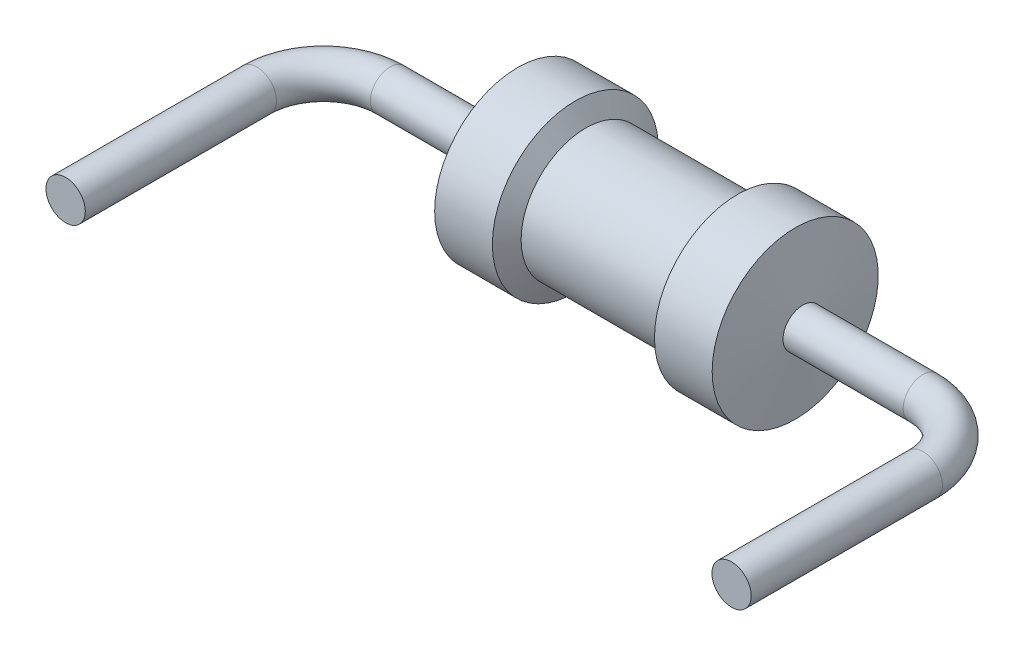
ISO-10303-21;
HEADER;
FILE_DESCRIPTION(('STEP AP214'),'2;1');
FILE_NAME('part.step','',(''),(''),'','','');
FILE_SCHEMA(('AUTOMOTIVE_DESIGN { 1 0 10303 214 1 1 1 1 }'));
ENDSEC;
DATA;
#1=APPLICATION_CONTEXT('core data for automotive mechanical design processes');
#2=APPLICATION_PROTOCOL_DEFINITION('international standard','automotive_design',2000,#1);
#3=PRODUCT_CONTEXT('',#1,'mechanical');
#4=PRODUCT('Part','Part','',(#3));
#5=PRODUCT_RELATED_PRODUCT_CATEGORY('part','',(#4));
#6=PRODUCT_DEFINITION_FORMATION('','',#4);
#7=PRODUCT_DEFINITION_CONTEXT('part definition',#1,'design');
#8=PRODUCT_DEFINITION('design','',#6,#7);
#9=PRODUCT_DEFINITION_SHAPE('','',#8);
#10=(LENGTH_UNIT() NAMED_UNIT(*) SI_UNIT(.MILLI.,.METRE.));
#11=(NAMED_UNIT(*) PLANE_ANGLE_UNIT() SI_UNIT($,.RADIAN.));
#12=(NAMED_UNIT(*) SI_UNIT($,.STERADIAN.) SOLID_ANGLE_UNIT());
#13=UNCERTAINTY_MEASURE_WITH_UNIT(LENGTH_MEASURE(1.E-05),#10,'distance_accuracy_value','');
#14=(GEOMETRIC_REPRESENTATION_CONTEXT(3) GLOBAL_UNCERTAINTY_ASSIGNED_CONTEXT((#13)) GLOBAL_UNIT_ASSIGNED_CONTEXT((#10,
#11,#12)) REPRESENTATION_CONTEXT('',''));
#15=CARTESIAN_POINT('',(0.,0.,0.));
#16=DIRECTION('',(0.,0.,1.));
#17=DIRECTION('',(1.,0.,0.));
#18=AXIS2_PLACEMENT_3D('',#15,#16,#17);
#19=CARTESIAN_POINT('',(5.51,0.,0.));
#20=DIRECTION('',(-1.,0.,0.));
#21=DIRECTION('',(0.,0.,1.));
#22=AXIS2_PLACEMENT_3D('',#19,#20,#21);
#23=CONICAL_SURFACE('',#22,0.,1.45312202164846);
#24=CARTESIAN_POINT('',(5.39769053882616,0.,0.));
#25=DIRECTION('',(-1.,0.,0.));
#26=DIRECTION('',(0.,0.,1.));
#27=AXIS2_PLACEMENT_3D('',#24,#25,#26);
#28=CIRCLE('',#27,0.95);
#29=CARTESIAN_POINT('',(5.39769053882616,0.,0.95));
#30=VERTEX_POINT('',#29);
#31=EDGE_CURVE('E42',#30,#30,#28,.T.);
#32=ORIENTED_EDGE('',*,*,#31,.F.);
#33=EDGE_LOOP('',(#32));
#34=FACE_BOUND('',#33,.T.);
#35=CARTESIAN_POINT('',(5.48340039077461,0.,0.));
#36=DIRECTION('',(-1.,0.,0.));
#37=DIRECTION('',(0.,0.,1.));
#38=AXIS2_PLACEMENT_3D('',#35,#36,#37);
#39=CIRCLE('',#38,0.225);
#40=CARTESIAN_POINT('',(5.48340039077461,0.,0.225));
#41=VERTEX_POINT('',#40);
#42=EDGE_CURVE('E10',#41,#41,#39,.F.);
#43=ORIENTED_EDGE('',*,*,#42,.F.);
#44=EDGE_LOOP('',(#43));
#45=FACE_BOUND('',#44,.T.);
#46=ADVANCED_FACE('F31',(#34,#45),#23,.T.);
#47=CARTESIAN_POINT('',(2.22230946117384,0.,0.));
#48=DIRECTION('',(1.,0.,0.));
#49=DIRECTION('',(0.,0.,-1.));
#50=AXIS2_PLACEMENT_3D('',#47,#48,#49);
#51=CONICAL_SURFACE('',#50,0.95,1.45312202164846);
#52=CARTESIAN_POINT('',(2.22230946117384,0.,0.));
#53=DIRECTION('',(-1.,0.,0.));
#54=DIRECTION('',(0.,0.,1.));
#55=AXIS2_PLACEMENT_3D('',#52,#53,#54);
#56=CIRCLE('',#55,0.95);
#57=CARTESIAN_POINT('',(2.22230946117384,0.,0.95));
#58=VERTEX_POINT('',#57);
#59=EDGE_CURVE('E47',#58,#58,#56,.T.);
#60=ORIENTED_EDGE('',*,*,#59,.T.);
#61=EDGE_LOOP('',(#60));
#62=FACE_BOUND('',#61,.T.);
#63=CARTESIAN_POINT('',(2.13659960922538,0.,0.));
#64=DIRECTION('',(1.,0.,0.));
#65=DIRECTION('',(0.,0.,-1.));
#66=AXIS2_PLACEMENT_3D('',#63,#64,#65);
#67=CIRCLE('',#66,0.225);
#68=CARTESIAN_POINT('',(2.13659960922538,0.,-0.225));
#69=VERTEX_POINT('',#68);
#70=EDGE_CURVE('E34',#69,#69,#67,.F.);
#71=ORIENTED_EDGE('',*,*,#70,.F.);
#72=EDGE_LOOP('',(#71));
#73=FACE_BOUND('',#72,.T.);
#74=ADVANCED_FACE('F68',(#62,#73),#51,.T.);
#75=CARTESIAN_POINT('',(0.,0.,0.));
#76=DIRECTION('',(-1.,0.,0.));
#77=DIRECTION('',(0.,0.,1.));
#78=AXIS2_PLACEMENT_3D('',#75,#76,#77);
#79=CYLINDRICAL_SURFACE('',#78,0.95);
#80=CARTESIAN_POINT('',(4.73729053882616,0.,0.));
#81=DIRECTION('',(-1.,0.,0.));
#82=DIRECTION('',(0.,0.,1.));
#83=AXIS2_PLACEMENT_3D('',#80,#81,#82);
#84=CIRCLE('',#83,0.95);
#85=CARTESIAN_POINT('',(4.73729053882616,0.,0.95));
#86=VERTEX_POINT('',#85);
#87=EDGE_CURVE('E59',#86,#86,#84,.T.);
#88=ORIENTED_EDGE('',*,*,#87,.F.);
#89=EDGE_LOOP('',(#88));
#90=FACE_BOUND('',#89,.T.);
#91=ORIENTED_EDGE('',*,*,#31,.T.);
#92=EDGE_LOOP('',(#91));
#93=FACE_BOUND('',#92,.T.);
#94=ADVANCED_FACE('F64',(#90,#93),#79,.T.);
#95=CARTESIAN_POINT('',(4.73729053882616,0.,0.));
#96=DIRECTION('',(1.,0.,0.));
#97=DIRECTION('',(0.,0.,-1.));
#98=AXIS2_PLACEMENT_3D('',#95,#96,#97);
#99=CONICAL_SURFACE('',#98,0.95,1.0569985691051);
#100=CARTESIAN_POINT('',(4.61867420705743,0.,0.));
#101=DIRECTION('',(-1.,0.,0.));
#102=DIRECTION('',(0.,0.,1.));
#103=AXIS2_PLACEMENT_3D('',#100,#101,#102);
#104=CIRCLE('',#103,0.73981978437736);
#105=CARTESIAN_POINT('',(4.61867420705743,0.,0.73981978437736));
#106=VERTEX_POINT('',#105);
#107=EDGE_CURVE('E56',#106,#106,#104,.T.);
#108=ORIENTED_EDGE('',*,*,#107,.F.);
#109=EDGE_LOOP('',(#108));
#110=FACE_BOUND('',#109,.T.);
#111=ORIENTED_EDGE('',*,*,#87,.T.);
#112=EDGE_LOOP('',(#111));
#113=FACE_BOUND('',#112,.T.);
#114=ADVANCED_FACE('F77',(#110,#113),#99,.T.);
#115=CARTESIAN_POINT('',(0.,0.,0.));
#116=DIRECTION('',(-1.,0.,0.));
#117=DIRECTION('',(0.,0.,1.));
#118=AXIS2_PLACEMENT_3D('',#115,#116,#117);
#119=CYLINDRICAL_SURFACE('',#118,0.73981978437736);
#120=CARTESIAN_POINT('',(3.00132579294256,0.,0.));
#121=DIRECTION('',(-1.,0.,0.));
#122=DIRECTION('',(0.,0.,1.));
#123=AXIS2_PLACEMENT_3D('',#120,#121,#122);
#124=CIRCLE('',#123,0.73981978437736);
#125=CARTESIAN_POINT('',(3.00132579294256,0.,0.73981978437736));
#126=VERTEX_POINT('',#125);
#127=EDGE_CURVE('E53',#126,#126,#124,.T.);
#128=ORIENTED_EDGE('',*,*,#127,.F.);
#129=EDGE_LOOP('',(#128));
#130=FACE_BOUND('',#129,.T.);
#131=ORIENTED_EDGE('',*,*,#107,.T.);
#132=EDGE_LOOP('',(#131));
#133=FACE_BOUND('',#132,.T.);
#134=ADVANCED_FACE('F92',(#130,#133),#119,.T.);
#135=CARTESIAN_POINT('',(3.00132579294256,0.,0.));
#136=DIRECTION('',(-1.,0.,0.));
#137=DIRECTION('',(0.,0.,1.));
#138=AXIS2_PLACEMENT_3D('',#135,#136,#137);
#139=CONICAL_SURFACE('',#138,0.73981978437736,1.0569985691051);
#140=CARTESIAN_POINT('',(2.88270946117384,0.,0.));
#141=DIRECTION('',(-1.,0.,0.));
#142=DIRECTION('',(0.,0.,1.));
#143=AXIS2_PLACEMENT_3D('',#140,#141,#142);
#144=CIRCLE('',#143,0.95);
#145=CARTESIAN_POINT('',(2.88270946117384,0.,0.95));
#146=VERTEX_POINT('',#145);
#147=EDGE_CURVE('E50',#146,#146,#144,.T.);
#148=ORIENTED_EDGE('',*,*,#147,.F.);
#149=EDGE_LOOP('',(#148));
#150=FACE_BOUND('',#149,.T.);
#151=ORIENTED_EDGE('',*,*,#127,.T.);
#152=EDGE_LOOP('',(#151));
#153=FACE_BOUND('',#152,.T.);
#154=ADVANCED_FACE('F88',(#150,#153),#139,.T.);
#155=CARTESIAN_POINT('',(0.,0.,0.));
#156=DIRECTION('',(-1.,0.,0.));
#157=DIRECTION('',(0.,0.,1.));
#158=AXIS2_PLACEMENT_3D('',#155,#156,#157);
#159=CYLINDRICAL_SURFACE('',#158,0.95);
#160=ORIENTED_EDGE('',*,*,#59,.F.);
#161=EDGE_LOOP('',(#160));
#162=FACE_BOUND('',#161,.T.);
#163=ORIENTED_EDGE('',*,*,#147,.T.);
#164=EDGE_LOOP('',(#163));
#165=FACE_BOUND('',#164,.T.);
#166=ADVANCED_FACE('F84',(#162,#165),#159,.T.);
#167=CARTESIAN_POINT('',(0.,0.,0.762000000000005));
#168=DIRECTION('',(0.,0.,1.));
#169=DIRECTION('',(1.,0.,0.));
#170=AXIS2_PLACEMENT_3D('',#167,#168,#169);
#171=CYLINDRICAL_SURFACE('',#170,0.225);
#172=CARTESIAN_POINT('',(0.,0.,0.762000000000005));
#173=DIRECTION('',(0.,0.,1.));
#174=DIRECTION('',(1.,0.,0.));
#175=AXIS2_PLACEMENT_3D('',#172,#173,#174);
#176=CIRCLE('',#175,0.225);
#177=CARTESIAN_POINT('',(-0.225,0.,0.762000000000007));
#178=VERTEX_POINT('',#177);
#179=EDGE_CURVE('E241',#178,#178,#176,.T.);
#180=ORIENTED_EDGE('',*,*,#179,.T.);
#181=EDGE_LOOP('',(#180));
#182=FACE_BOUND('',#181,.T.);
#183=CARTESIAN_POINT('',(0.,0.,2.949999878));
#184=DIRECTION('',(0.,0.,1.));
#185=DIRECTION('',(1.,0.,0.));
#186=AXIS2_PLACEMENT_3D('',#183,#184,#185);
#187=CIRCLE('',#186,0.225);
#188=CARTESIAN_POINT('',(0.225,0.,2.949999878));
#189=VERTEX_POINT('',#188);
#190=EDGE_CURVE('E238',#189,#189,#187,.T.);
#191=ORIENTED_EDGE('',*,*,#190,.F.);
#192=EDGE_LOOP('',(#191));
#193=FACE_BOUND('',#192,.T.);
#194=ADVANCED_FACE('F87',(#182,#193),#171,.T.);
#195=CARTESIAN_POINT('',(0.762,0.,0.762));
#196=DIRECTION('',(0.,-1.,0.));
#197=DIRECTION('',(0.,0.,-1.));
#198=AXIS2_PLACEMENT_3D('',#195,#196,#197);
#199=TOROIDAL_SURFACE('',#198,0.762,0.225);
#200=CARTESIAN_POINT('',(0.762000000000005,0.,0.));
#201=DIRECTION('',(-1.,0.,0.));
#202=DIRECTION('',(0.,0.,1.));
#203=AXIS2_PLACEMENT_3D('',#200,#201,#202);
#204=CIRCLE('',#203,0.225);
#205=CARTESIAN_POINT('',(0.762000000000007,0.,-0.225));
#206=VERTEX_POINT('',#205);
#207=EDGE_CURVE('E246',#206,#206,#204,.T.);
#208=CARTESIAN_POINT('',(0.762,0.,0.762));
#209=DIRECTION('',(0.,-1.,0.));
#210=DIRECTION('',(0.,0.,-1.));
#211=AXIS2_PLACEMENT_3D('',#208,#209,#210);
#212=CIRCLE('',#211,0.987);
#213=EDGE_CURVE('',#178,#206,#212,.T.);
#214=ORIENTED_EDGE('',*,*,#179,.F.);
#215=ORIENTED_EDGE('',*,*,#207,.T.);
#216=ORIENTED_EDGE('',*,*,#213,.T.);
#217=ORIENTED_EDGE('',*,*,#213,.F.);
#218=EDGE_LOOP('',(#214,#216,#215,#217));
#219=FACE_BOUND('',#218,.T.);
#220=ADVANCED_FACE('F125',(#219),#199,.T.);
#221=CARTESIAN_POINT('',(0.762000000000005,0.,0.));
#222=DIRECTION('',(1.,0.,0.));
#223=DIRECTION('',(0.,0.,-1.));
#224=AXIS2_PLACEMENT_3D('',#221,#222,#223);
#225=CYLINDRICAL_SURFACE('',#224,0.225);
#226=ORIENTED_EDGE('',*,*,#207,.F.);
#227=EDGE_LOOP('',(#226));
#228=FACE_BOUND('',#227,.T.);
#229=ORIENTED_EDGE('',*,*,#70,.T.);
#230=EDGE_LOOP('',(#229));
#231=FACE_BOUND('',#230,.T.);
#232=ADVANCED_FACE('F135',(#228,#231),#225,.T.);
#233=CARTESIAN_POINT('',(6.85799999999999,0.,0.));
#234=DIRECTION('',(-1.,0.,0.));
#235=DIRECTION('',(0.,0.,1.));
#236=AXIS2_PLACEMENT_3D('',#233,#234,#235);
#237=CIRCLE('',#236,0.225);
#238=CARTESIAN_POINT('',(6.85799999999999,0.,-0.225));
#239=VERTEX_POINT('',#238);
#240=EDGE_CURVE('E248',#239,#239,#237,.T.);
#241=ORIENTED_EDGE('',*,*,#240,.T.);
#242=EDGE_LOOP('',(#241));
#243=FACE_BOUND('',#242,.T.);
#244=ORIENTED_EDGE('',*,*,#42,.T.);
#245=EDGE_LOOP('',(#244));
#246=FACE_BOUND('',#245,.T.);
#247=ADVANCED_FACE('F143',(#243,#246),#225,.T.);
#248=CARTESIAN_POINT('',(7.62,0.,0.762000000000006));
#249=DIRECTION('',(0.,0.,1.));
#250=DIRECTION('',(1.,0.,0.));
#251=AXIS2_PLACEMENT_3D('',#248,#249,#250);
#252=CYLINDRICAL_SURFACE('',#251,0.225);
#253=CARTESIAN_POINT('',(7.62,0.,0.762000000000006));
#254=DIRECTION('',(0.,0.,-1.));
#255=DIRECTION('',(-1.,0.,0.));
#256=AXIS2_PLACEMENT_3D('',#253,#254,#255);
#257=CIRCLE('',#256,0.225);
#258=CARTESIAN_POINT('',(7.845,0.,0.762000000000007));
#259=VERTEX_POINT('',#258);
#260=EDGE_CURVE('E45',#259,#259,#257,.T.);
#261=ORIENTED_EDGE('',*,*,#260,.F.);
#262=EDGE_LOOP('',(#261));
#263=FACE_BOUND('',#262,.T.);
#264=CARTESIAN_POINT('',(7.62,0.,2.949999878));
#265=DIRECTION('',(0.,0.,1.));
#266=DIRECTION('',(1.,0.,0.));
#267=AXIS2_PLACEMENT_3D('',#264,#265,#266);
#268=CIRCLE('',#267,0.225);
#269=CARTESIAN_POINT('',(7.845,0.,2.949999878));
#270=VERTEX_POINT('',#269);
#271=EDGE_CURVE('E236',#270,#270,#268,.T.);
#272=ORIENTED_EDGE('',*,*,#271,.F.);
#273=EDGE_LOOP('',(#272));
#274=FACE_BOUND('',#273,.T.);
#275=ADVANCED_FACE('F82',(#263,#274),#252,.T.);
#276=CARTESIAN_POINT('',(6.858,0.,0.762));
#277=DIRECTION('',(0.,-1.,0.));
#278=DIRECTION('',(0.,0.,-1.));
#279=AXIS2_PLACEMENT_3D('',#276,#277,#278);
#280=TOROIDAL_SURFACE('',#279,0.762,0.225);
#281=CARTESIAN_POINT('',(6.858,0.,0.762));
#282=DIRECTION('',(0.,-1.,0.));
#283=DIRECTION('',(0.,0.,-1.));
#284=AXIS2_PLACEMENT_3D('',#281,#282,#283);
#285=CIRCLE('',#284,0.987);
#286=EDGE_CURVE('',#239,#259,#285,.T.);
#287=ORIENTED_EDGE('',*,*,#240,.F.);
#288=ORIENTED_EDGE('',*,*,#260,.T.);
#289=ORIENTED_EDGE('',*,*,#286,.T.);
#290=ORIENTED_EDGE('',*,*,#286,.F.);
#291=EDGE_LOOP('',(#287,#289,#288,#290));
#292=FACE_BOUND('',#291,.T.);
#293=ADVANCED_FACE('F156',(#292),#280,.T.);
#294=CARTESIAN_POINT('',(0.,0.,2.949999878));
#295=DIRECTION('',(0.,0.,1.));
#296=DIRECTION('',(1.,0.,0.));
#297=AXIS2_PLACEMENT_3D('',#294,#295,#296);
#298=PLANE('',#297);
#299=ORIENTED_EDGE('',*,*,#190,.T.);
#300=EDGE_LOOP('',(#299));
#301=FACE_BOUND('',#300,.T.);
#302=ADVANCED_FACE('F163',(#301),#298,.T.);
#303=CARTESIAN_POINT('',(7.62,0.,2.949999878));
#304=DIRECTION('',(0.,0.,1.));
#305=DIRECTION('',(1.,0.,0.));
#306=AXIS2_PLACEMENT_3D('',#303,#304,#305);
#307=PLANE('',#306);
#308=ORIENTED_EDGE('',*,*,#271,.T.);
#309=EDGE_LOOP('',(#308));
#310=FACE_BOUND('',#309,.T.);
#311=ADVANCED_FACE('F169',(#310),#307,.T.);
#312=CLOSED_SHELL('',(#46,#74,#94,#114,#134,#154,#166,#194,#220,#232,#247,#275,#293,#302,#311));
#313=MANIFOLD_SOLID_BREP('B2',#312);
#314=ADVANCED_BREP_SHAPE_REPRESENTATION('',(#18,#313),#14);
#315=SHAPE_DEFINITION_REPRESENTATION(#9,#314);
ENDSEC;
END-ISO-10303-21;
